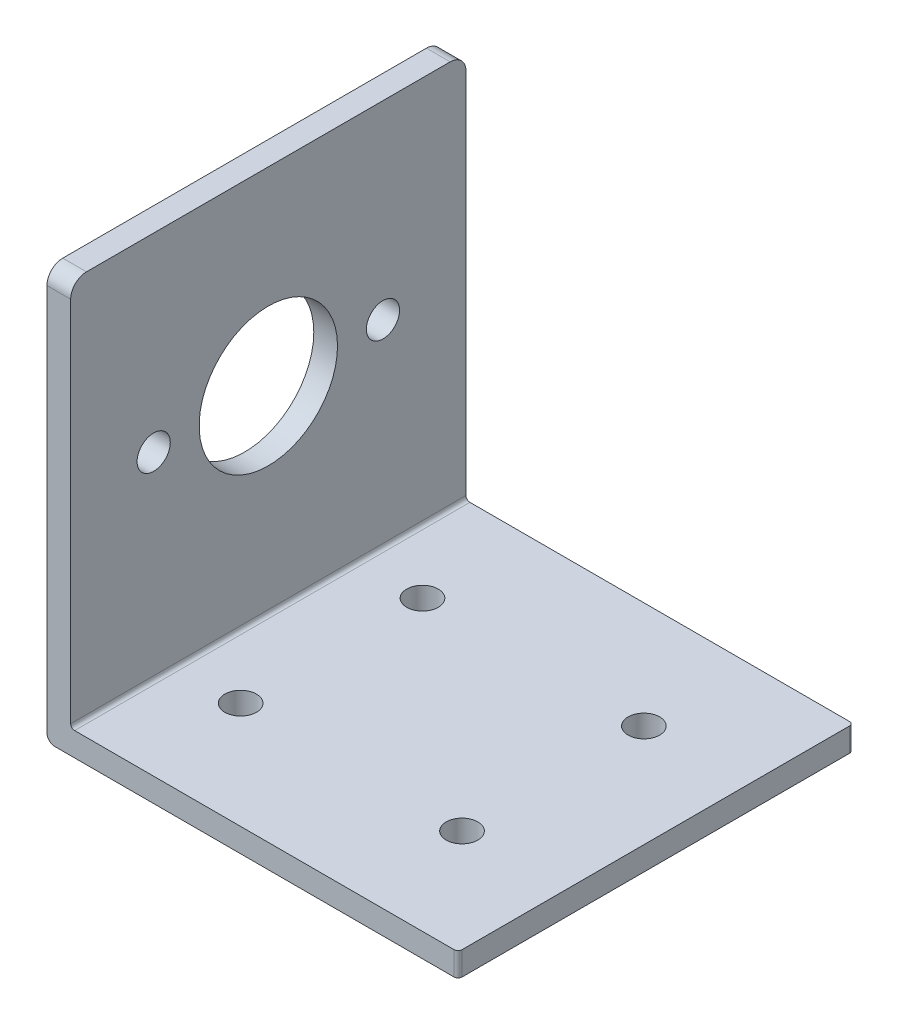
ISO-10303-21;
HEADER;
FILE_DESCRIPTION(('STEP AP214'),'2;1');
FILE_NAME('part.step','',(''),(''),'','','');
FILE_SCHEMA(('AUTOMOTIVE_DESIGN { 1 0 10303 214 1 1 1 1 }'));
ENDSEC;
DATA;
#1=APPLICATION_CONTEXT('core data for automotive mechanical design processes');
#2=APPLICATION_PROTOCOL_DEFINITION('international standard','automotive_design',2000,#1);
#3=PRODUCT_CONTEXT('',#1,'mechanical');
#4=PRODUCT('Part','Part','',(#3));
#5=PRODUCT_RELATED_PRODUCT_CATEGORY('part','',(#4));
#6=PRODUCT_DEFINITION_FORMATION('','',#4);
#7=PRODUCT_DEFINITION_CONTEXT('part definition',#1,'design');
#8=PRODUCT_DEFINITION('design','',#6,#7);
#9=PRODUCT_DEFINITION_SHAPE('','',#8);
#10=(LENGTH_UNIT() NAMED_UNIT(*) SI_UNIT(.MILLI.,.METRE.));
#11=(NAMED_UNIT(*) PLANE_ANGLE_UNIT() SI_UNIT($,.RADIAN.));
#12=(NAMED_UNIT(*) SI_UNIT($,.STERADIAN.) SOLID_ANGLE_UNIT());
#13=UNCERTAINTY_MEASURE_WITH_UNIT(LENGTH_MEASURE(1.E-05),#10,'distance_accuracy_value','');
#14=(GEOMETRIC_REPRESENTATION_CONTEXT(3) GLOBAL_UNCERTAINTY_ASSIGNED_CONTEXT((#13)) GLOBAL_UNIT_ASSIGNED_CONTEXT((#10,
#11,#12)) REPRESENTATION_CONTEXT('',''));
#15=CARTESIAN_POINT('',(0.,0.,0.));
#16=DIRECTION('',(0.,0.,1.));
#17=DIRECTION('',(1.,0.,0.));
#18=AXIS2_PLACEMENT_3D('',#15,#16,#17);
#19=CARTESIAN_POINT('',(49.,0.,50.));
#20=DIRECTION('',(0.,-1.,0.));
#21=DIRECTION('',(1.,0.,0.));
#22=AXIS2_PLACEMENT_3D('',#19,#20,#21);
#23=PLANE('',#22);
#24=CARTESIAN_POINT('',(36.,0.,13.5));
#25=DIRECTION('',(0.,1.,0.));
#26=DIRECTION('',(0.,0.,1.));
#27=AXIS2_PLACEMENT_3D('',#24,#25,#26);
#28=CIRCLE('',#27,2.);
#29=CARTESIAN_POINT('',(36.,0.,15.5));
#30=VERTEX_POINT('',#29);
#31=EDGE_CURVE('E274',#30,#30,#28,.T.);
#32=ORIENTED_EDGE('',*,*,#31,.F.);
#33=EDGE_LOOP('',(#32));
#34=FACE_BOUND('',#33,.T.);
#35=CARTESIAN_POINT('',(8.,0.,13.5));
#36=DIRECTION('',(0.,1.,0.));
#37=DIRECTION('',(0.,0.,1.));
#38=AXIS2_PLACEMENT_3D('',#35,#36,#37);
#39=CIRCLE('',#38,2.);
#40=CARTESIAN_POINT('',(8.,0.,15.5));
#41=VERTEX_POINT('',#40);
#42=EDGE_CURVE('E268',#41,#41,#39,.T.);
#43=ORIENTED_EDGE('',*,*,#42,.F.);
#44=EDGE_LOOP('',(#43));
#45=FACE_BOUND('',#44,.T.);
#46=CARTESIAN_POINT('',(36.,0.,36.5));
#47=DIRECTION('',(0.,1.,0.));
#48=DIRECTION('',(0.,0.,1.));
#49=AXIS2_PLACEMENT_3D('',#46,#47,#48);
#50=CIRCLE('',#49,2.);
#51=CARTESIAN_POINT('',(36.,0.,38.5));
#52=VERTEX_POINT('',#51);
#53=EDGE_CURVE('E262',#52,#52,#50,.T.);
#54=ORIENTED_EDGE('',*,*,#53,.F.);
#55=EDGE_LOOP('',(#54));
#56=FACE_BOUND('',#55,.T.);
#57=CARTESIAN_POINT('',(8.,0.,36.5));
#58=DIRECTION('',(0.,1.,0.));
#59=DIRECTION('',(0.,0.,1.));
#60=AXIS2_PLACEMENT_3D('',#57,#58,#59);
#61=CIRCLE('',#60,2.);
#62=CARTESIAN_POINT('',(8.,0.,38.5));
#63=VERTEX_POINT('',#62);
#64=EDGE_CURVE('E256',#63,#63,#61,.T.);
#65=ORIENTED_EDGE('',*,*,#64,.F.);
#66=EDGE_LOOP('',(#65));
#67=FACE_BOUND('',#66,.T.);
#68=DIRECTION('',(0.,0.,-1.));
#69=VECTOR('',#68,1.);
#70=CARTESIAN_POINT('',(49.,0.,50.));
#71=LINE('',#70,#69);
#72=CARTESIAN_POINT('',(49.,0.,49.5));
#73=VERTEX_POINT('',#72);
#74=CARTESIAN_POINT('',(49.,0.,0.5));
#75=VERTEX_POINT('',#74);
#76=EDGE_CURVE('E152',#73,#75,#71,.T.);
#77=ORIENTED_EDGE('',*,*,#76,.T.);
#78=CARTESIAN_POINT('',(48.5,0.,0.5));
#79=DIRECTION('',(0.,-1.,0.));
#80=DIRECTION('',(1.,0.,0.));
#81=AXIS2_PLACEMENT_3D('',#78,#79,#80);
#82=CIRCLE('',#81,0.5);
#83=CARTESIAN_POINT('',(48.5,0.,0.));
#84=VERTEX_POINT('',#83);
#85=EDGE_CURVE('E224',#75,#84,#82,.F.);
#86=ORIENTED_EDGE('',*,*,#85,.T.);
#87=DIRECTION('',(-1.,0.,0.));
#88=VECTOR('',#87,1.);
#89=CARTESIAN_POINT('',(49.,0.,0.));
#90=LINE('',#89,#88);
#91=CARTESIAN_POINT('',(0.5,0.,0.));
#92=VERTEX_POINT('',#91);
#93=EDGE_CURVE('E156',#84,#92,#90,.T.);
#94=ORIENTED_EDGE('',*,*,#93,.T.);
#95=DIRECTION('',(0.,0.,-1.));
#96=VECTOR('',#95,1.);
#97=CARTESIAN_POINT('',(0.5,0.,50.));
#98=LINE('',#97,#96);
#99=CARTESIAN_POINT('',(0.5,0.,50.));
#100=VERTEX_POINT('',#99);
#101=EDGE_CURVE('E209',#92,#100,#98,.F.);
#102=ORIENTED_EDGE('',*,*,#101,.T.);
#103=DIRECTION('',(-1.,0.,0.));
#104=VECTOR('',#103,1.);
#105=CARTESIAN_POINT('',(49.,0.,50.));
#106=LINE('',#105,#104);
#107=CARTESIAN_POINT('',(48.5,0.,50.));
#108=VERTEX_POINT('',#107);
#109=EDGE_CURVE('E166',#108,#100,#106,.T.);
#110=ORIENTED_EDGE('',*,*,#109,.F.);
#111=CARTESIAN_POINT('',(48.5,0.,49.5));
#112=DIRECTION('',(0.,-1.,0.));
#113=DIRECTION('',(1.,0.,0.));
#114=AXIS2_PLACEMENT_3D('',#111,#112,#113);
#115=CIRCLE('',#114,0.5);
#116=EDGE_CURVE('E222',#108,#73,#115,.F.);
#117=ORIENTED_EDGE('',*,*,#116,.T.);
#118=EDGE_LOOP('',(#77,#86,#94,#102,#110,#117));
#119=FACE_BOUND('',#118,.T.);
#120=ADVANCED_FACE('F33',(#34,#45,#56,#67,#119),#23,.F.);
#121=CARTESIAN_POINT('',(0.,0.,50.));
#122=DIRECTION('',(-1.,0.,0.));
#123=DIRECTION('',(0.,0.,1.));
#124=AXIS2_PLACEMENT_3D('',#121,#122,#123);
#125=PLANE('',#124);
#126=CARTESIAN_POINT('',(0.,25.,39.5));
#127=DIRECTION('',(1.,0.,0.));
#128=DIRECTION('',(0.,0.,-1.));
#129=AXIS2_PLACEMENT_3D('',#126,#127,#128);
#130=CIRCLE('',#129,2.1);
#131=CARTESIAN_POINT('',(0.,25.,37.4));
#132=VERTEX_POINT('',#131);
#133=EDGE_CURVE('E188',#132,#132,#130,.T.);
#134=ORIENTED_EDGE('',*,*,#133,.F.);
#135=EDGE_LOOP('',(#134));
#136=FACE_BOUND('',#135,.T.);
#137=CARTESIAN_POINT('',(0.,25.,10.5));
#138=DIRECTION('',(1.,0.,0.));
#139=DIRECTION('',(0.,0.,-1.));
#140=AXIS2_PLACEMENT_3D('',#137,#138,#139);
#141=CIRCLE('',#140,2.1);
#142=CARTESIAN_POINT('',(0.,25.,8.4));
#143=VERTEX_POINT('',#142);
#144=EDGE_CURVE('E184',#143,#143,#141,.T.);
#145=ORIENTED_EDGE('',*,*,#144,.F.);
#146=EDGE_LOOP('',(#145));
#147=FACE_BOUND('',#146,.T.);
#148=CARTESIAN_POINT('',(0.,25.,25.));
#149=DIRECTION('',(1.,0.,0.));
#150=DIRECTION('',(0.,0.,-1.));
#151=AXIS2_PLACEMENT_3D('',#148,#149,#150);
#152=CIRCLE('',#151,8.75);
#153=CARTESIAN_POINT('',(0.,25.,16.25));
#154=VERTEX_POINT('',#153);
#155=EDGE_CURVE('E180',#154,#154,#152,.T.);
#156=ORIENTED_EDGE('',*,*,#155,.F.);
#157=EDGE_LOOP('',(#156));
#158=FACE_BOUND('',#157,.T.);
#159=DIRECTION('',(0.,1.,0.));
#160=VECTOR('',#159,1.);
#161=CARTESIAN_POINT('',(0.,0.,50.));
#162=LINE('',#161,#160);
#163=CARTESIAN_POINT('',(0.,0.5,50.));
#164=VERTEX_POINT('',#163);
#165=CARTESIAN_POINT('',(0.,47.,50.));
#166=VERTEX_POINT('',#165);
#167=EDGE_CURVE('E135',#164,#166,#162,.T.);
#168=ORIENTED_EDGE('',*,*,#167,.F.);
#169=DIRECTION('',(0.,0.,-1.));
#170=VECTOR('',#169,1.);
#171=CARTESIAN_POINT('',(0.,0.5,0.));
#172=LINE('',#171,#170);
#173=CARTESIAN_POINT('',(0.,0.5,0.));
#174=VERTEX_POINT('',#173);
#175=EDGE_CURVE('E206',#164,#174,#172,.T.);
#176=ORIENTED_EDGE('',*,*,#175,.T.);
#177=DIRECTION('',(0.,1.,0.));
#178=VECTOR('',#177,1.);
#179=CARTESIAN_POINT('',(0.,0.,0.));
#180=LINE('',#179,#178);
#181=CARTESIAN_POINT('',(0.,47.,0.));
#182=VERTEX_POINT('',#181);
#183=EDGE_CURVE('E158',#174,#182,#180,.T.);
#184=ORIENTED_EDGE('',*,*,#183,.T.);
#185=CARTESIAN_POINT('',(0.,47.,2.));
#186=DIRECTION('',(-1.,0.,0.));
#187=DIRECTION('',(0.,0.,1.));
#188=AXIS2_PLACEMENT_3D('',#185,#186,#187);
#189=CIRCLE('',#188,2.);
#190=CARTESIAN_POINT('',(0.,49.,2.));
#191=VERTEX_POINT('',#190);
#192=EDGE_CURVE('E194',#182,#191,#189,.F.);
#193=ORIENTED_EDGE('',*,*,#192,.T.);
#194=DIRECTION('',(0.,0.,-1.));
#195=VECTOR('',#194,1.);
#196=CARTESIAN_POINT('',(0.,49.,50.));
#197=LINE('',#196,#195);
#198=CARTESIAN_POINT('',(0.,49.,48.));
#199=VERTEX_POINT('',#198);
#200=EDGE_CURVE('E174',#199,#191,#197,.T.);
#201=ORIENTED_EDGE('',*,*,#200,.F.);
#202=CARTESIAN_POINT('',(0.,47.,48.));
#203=DIRECTION('',(-1.,0.,0.));
#204=DIRECTION('',(0.,0.,1.));
#205=AXIS2_PLACEMENT_3D('',#202,#203,#204);
#206=CIRCLE('',#205,2.);
#207=EDGE_CURVE('E191',#199,#166,#206,.F.);
#208=ORIENTED_EDGE('',*,*,#207,.T.);
#209=EDGE_LOOP('',(#168,#176,#184,#193,#201,#208));
#210=FACE_BOUND('',#209,.T.);
#211=ADVANCED_FACE('F282',(#136,#147,#158,#210),#125,.F.);
#212=CARTESIAN_POINT('',(-3.,49.,50.));
#213=DIRECTION('',(0.,1.,0.));
#214=DIRECTION('',(0.,0.,1.));
#215=AXIS2_PLACEMENT_3D('',#212,#213,#214);
#216=PLANE('',#215);
#217=ORIENTED_EDGE('',*,*,#200,.T.);
#218=DIRECTION('',(1.,0.,0.));
#219=VECTOR('',#218,1.);
#220=CARTESIAN_POINT('',(-3.,49.,2.));
#221=LINE('',#220,#219);
#222=CARTESIAN_POINT('',(-3.,49.,2.));
#223=VERTEX_POINT('',#222);
#224=EDGE_CURVE('E199',#191,#223,#221,.F.);
#225=ORIENTED_EDGE('',*,*,#224,.T.);
#226=DIRECTION('',(0.,0.,-1.));
#227=VECTOR('',#226,1.);
#228=CARTESIAN_POINT('',(-3.,49.,50.));
#229=LINE('',#228,#227);
#230=CARTESIAN_POINT('',(-3.,49.,48.));
#231=VERTEX_POINT('',#230);
#232=EDGE_CURVE('E145',#231,#223,#229,.T.);
#233=ORIENTED_EDGE('',*,*,#232,.F.);
#234=DIRECTION('',(1.,0.,0.));
#235=VECTOR('',#234,1.);
#236=CARTESIAN_POINT('',(-3.,49.,48.));
#237=LINE('',#236,#235);
#238=EDGE_CURVE('E196',#231,#199,#237,.T.);
#239=ORIENTED_EDGE('',*,*,#238,.T.);
#240=EDGE_LOOP('',(#217,#225,#233,#239));
#241=FACE_BOUND('',#240,.T.);
#242=ADVANCED_FACE('F332',(#241),#216,.T.);
#243=CARTESIAN_POINT('',(-3.,49.,50.));
#244=DIRECTION('',(1.,0.,0.));
#245=DIRECTION('',(0.,1.,0.));
#246=AXIS2_PLACEMENT_3D('',#243,#244,#245);
#247=PLANE('',#246);
#248=CARTESIAN_POINT('',(-3.,25.,39.5));
#249=DIRECTION('',(1.,0.,0.));
#250=DIRECTION('',(0.,1.,0.));
#251=AXIS2_PLACEMENT_3D('',#248,#249,#250);
#252=CIRCLE('',#251,2.1);
#253=CARTESIAN_POINT('',(-3.,27.1,39.5));
#254=VERTEX_POINT('',#253);
#255=EDGE_CURVE('E185',#254,#254,#252,.T.);
#256=ORIENTED_EDGE('',*,*,#255,.T.);
#257=EDGE_LOOP('',(#256));
#258=FACE_BOUND('',#257,.T.);
#259=CARTESIAN_POINT('',(-3.,25.,10.5));
#260=DIRECTION('',(1.,0.,0.));
#261=DIRECTION('',(0.,1.,0.));
#262=AXIS2_PLACEMENT_3D('',#259,#260,#261);
#263=CIRCLE('',#262,2.1);
#264=CARTESIAN_POINT('',(-3.,27.1,10.5));
#265=VERTEX_POINT('',#264);
#266=EDGE_CURVE('E181',#265,#265,#263,.T.);
#267=ORIENTED_EDGE('',*,*,#266,.T.);
#268=EDGE_LOOP('',(#267));
#269=FACE_BOUND('',#268,.T.);
#270=CARTESIAN_POINT('',(-3.,25.,25.));
#271=DIRECTION('',(1.,0.,0.));
#272=DIRECTION('',(0.,1.,0.));
#273=AXIS2_PLACEMENT_3D('',#270,#271,#272);
#274=CIRCLE('',#273,8.75);
#275=CARTESIAN_POINT('',(-3.,33.75,25.));
#276=VERTEX_POINT('',#275);
#277=EDGE_CURVE('E159',#276,#276,#274,.T.);
#278=ORIENTED_EDGE('',*,*,#277,.T.);
#279=EDGE_LOOP('',(#278));
#280=FACE_BOUND('',#279,.T.);
#281=ORIENTED_EDGE('',*,*,#232,.T.);
#282=CARTESIAN_POINT('',(-3.,47.,2.));
#283=DIRECTION('',(1.,0.,0.));
#284=DIRECTION('',(0.,1.,0.));
#285=AXIS2_PLACEMENT_3D('',#282,#283,#284);
#286=CIRCLE('',#285,2.);
#287=CARTESIAN_POINT('',(-3.,47.,0.));
#288=VERTEX_POINT('',#287);
#289=EDGE_CURVE('E203',#223,#288,#286,.F.);
#290=ORIENTED_EDGE('',*,*,#289,.T.);
#291=DIRECTION('',(0.,-1.,0.));
#292=VECTOR('',#291,1.);
#293=CARTESIAN_POINT('',(-3.,49.,0.));
#294=LINE('',#293,#292);
#295=CARTESIAN_POINT('',(-3.,-2.,0.));
#296=VERTEX_POINT('',#295);
#297=EDGE_CURVE('E142',#288,#296,#294,.T.);
#298=ORIENTED_EDGE('',*,*,#297,.T.);
#299=DIRECTION('',(0.,0.,-1.));
#300=VECTOR('',#299,1.);
#301=CARTESIAN_POINT('',(-3.,-2.,50.));
#302=LINE('',#301,#300);
#303=CARTESIAN_POINT('',(-3.,-2.,50.));
#304=VERTEX_POINT('',#303);
#305=EDGE_CURVE('E138',#304,#296,#302,.T.);
#306=ORIENTED_EDGE('',*,*,#305,.F.);
#307=DIRECTION('',(0.,-1.,0.));
#308=VECTOR('',#307,1.);
#309=CARTESIAN_POINT('',(-3.,49.,50.));
#310=LINE('',#309,#308);
#311=CARTESIAN_POINT('',(-3.,47.,50.));
#312=VERTEX_POINT('',#311);
#313=EDGE_CURVE('E125',#312,#304,#310,.T.);
#314=ORIENTED_EDGE('',*,*,#313,.F.);
#315=CARTESIAN_POINT('',(-3.,47.,48.));
#316=DIRECTION('',(1.,0.,0.));
#317=DIRECTION('',(0.,1.,0.));
#318=AXIS2_PLACEMENT_3D('',#315,#316,#317);
#319=CIRCLE('',#318,2.);
#320=EDGE_CURVE('E201',#312,#231,#319,.F.);
#321=ORIENTED_EDGE('',*,*,#320,.T.);
#322=EDGE_LOOP('',(#281,#290,#298,#306,#314,#321));
#323=FACE_BOUND('',#322,.T.);
#324=ADVANCED_FACE('F140',(#258,#269,#280,#323),#247,.F.);
#325=CARTESIAN_POINT('',(-2.,-2.,50.));
#326=DIRECTION('',(0.,0.,-1.));
#327=DIRECTION('',(-1.,0.,0.));
#328=AXIS2_PLACEMENT_3D('',#325,#326,#327);
#329=CYLINDRICAL_SURFACE('',#328,1.);
#330=CARTESIAN_POINT('',(-2.,-2.,0.));
#331=DIRECTION('',(0.,0.,1.));
#332=DIRECTION('',(1.,0.,0.));
#333=AXIS2_PLACEMENT_3D('',#330,#331,#332);
#334=CIRCLE('',#333,1.);
#335=CARTESIAN_POINT('',(-2.,-3.,0.));
#336=VERTEX_POINT('',#335);
#337=EDGE_CURVE('E162',#296,#336,#334,.T.);
#338=ORIENTED_EDGE('',*,*,#337,.T.);
#339=DIRECTION('',(0.,0.,-1.));
#340=VECTOR('',#339,1.);
#341=CARTESIAN_POINT('',(-2.,-3.,50.));
#342=LINE('',#341,#340);
#343=CARTESIAN_POINT('',(-2.,-3.,50.));
#344=VERTEX_POINT('',#343);
#345=EDGE_CURVE('E146',#344,#336,#342,.T.);
#346=ORIENTED_EDGE('',*,*,#345,.F.);
#347=CARTESIAN_POINT('',(-2.,-2.,50.));
#348=DIRECTION('',(0.,0.,1.));
#349=DIRECTION('',(1.,0.,0.));
#350=AXIS2_PLACEMENT_3D('',#347,#348,#349);
#351=CIRCLE('',#350,1.);
#352=EDGE_CURVE('E129',#304,#344,#351,.T.);
#353=ORIENTED_EDGE('',*,*,#352,.F.);
#354=ORIENTED_EDGE('',*,*,#305,.T.);
#355=EDGE_LOOP('',(#338,#346,#353,#354));
#356=FACE_BOUND('',#355,.T.);
#357=ADVANCED_FACE('F148',(#356),#329,.T.);
#358=CARTESIAN_POINT('',(-2.,-3.,50.));
#359=DIRECTION('',(0.,1.,0.));
#360=DIRECTION('',(0.,0.,1.));
#361=AXIS2_PLACEMENT_3D('',#358,#359,#360);
#362=PLANE('',#361);
#363=CARTESIAN_POINT('',(36.,-3.,13.5));
#364=DIRECTION('',(0.,1.,0.));
#365=DIRECTION('',(0.,0.,1.));
#366=AXIS2_PLACEMENT_3D('',#363,#364,#365);
#367=CIRCLE('',#366,2.);
#368=CARTESIAN_POINT('',(36.,-3.,15.5));
#369=VERTEX_POINT('',#368);
#370=EDGE_CURVE('E271',#369,#369,#367,.T.);
#371=ORIENTED_EDGE('',*,*,#370,.T.);
#372=EDGE_LOOP('',(#371));
#373=FACE_BOUND('',#372,.T.);
#374=CARTESIAN_POINT('',(8.,-3.00000000000001,13.5));
#375=DIRECTION('',(0.,1.,0.));
#376=DIRECTION('',(0.,0.,1.));
#377=AXIS2_PLACEMENT_3D('',#374,#375,#376);
#378=CIRCLE('',#377,2.);
#379=CARTESIAN_POINT('',(8.,-3.00000000000001,15.5));
#380=VERTEX_POINT('',#379);
#381=EDGE_CURVE('E265',#380,#380,#378,.T.);
#382=ORIENTED_EDGE('',*,*,#381,.T.);
#383=EDGE_LOOP('',(#382));
#384=FACE_BOUND('',#383,.T.);
#385=CARTESIAN_POINT('',(36.,-3.,36.5));
#386=DIRECTION('',(0.,1.,0.));
#387=DIRECTION('',(0.,0.,1.));
#388=AXIS2_PLACEMENT_3D('',#385,#386,#387);
#389=CIRCLE('',#388,2.);
#390=CARTESIAN_POINT('',(36.,-3.,38.5));
#391=VERTEX_POINT('',#390);
#392=EDGE_CURVE('E259',#391,#391,#389,.T.);
#393=ORIENTED_EDGE('',*,*,#392,.T.);
#394=EDGE_LOOP('',(#393));
#395=FACE_BOUND('',#394,.T.);
#396=CARTESIAN_POINT('',(8.,-3.00000000000001,36.5));
#397=DIRECTION('',(0.,1.,0.));
#398=DIRECTION('',(0.,0.,1.));
#399=AXIS2_PLACEMENT_3D('',#396,#397,#398);
#400=CIRCLE('',#399,2.);
#401=CARTESIAN_POINT('',(8.,-3.00000000000001,38.5));
#402=VERTEX_POINT('',#401);
#403=EDGE_CURVE('E253',#402,#402,#400,.T.);
#404=ORIENTED_EDGE('',*,*,#403,.T.);
#405=EDGE_LOOP('',(#404));
#406=FACE_BOUND('',#405,.T.);
#407=DIRECTION('',(1.,0.,0.));
#408=VECTOR('',#407,1.);
#409=CARTESIAN_POINT('',(-2.,-3.,0.));
#410=LINE('',#409,#408);
#411=CARTESIAN_POINT('',(48.5,-3.,0.));
#412=VERTEX_POINT('',#411);
#413=EDGE_CURVE('E164',#336,#412,#410,.T.);
#414=ORIENTED_EDGE('',*,*,#413,.T.);
#415=CARTESIAN_POINT('',(48.5,-3.,0.5));
#416=DIRECTION('',(0.,1.,0.));
#417=DIRECTION('',(0.,0.,1.));
#418=AXIS2_PLACEMENT_3D('',#415,#416,#417);
#419=CIRCLE('',#418,0.5);
#420=CARTESIAN_POINT('',(49.,-3.,0.5));
#421=VERTEX_POINT('',#420);
#422=EDGE_CURVE('E41',#412,#421,#419,.F.);
#423=ORIENTED_EDGE('',*,*,#422,.T.);
#424=DIRECTION('',(0.,0.,-1.));
#425=VECTOR('',#424,1.);
#426=CARTESIAN_POINT('',(49.,-3.,50.));
#427=LINE('',#426,#425);
#428=CARTESIAN_POINT('',(49.,-3.,49.5));
#429=VERTEX_POINT('',#428);
#430=EDGE_CURVE('E169',#429,#421,#427,.T.);
#431=ORIENTED_EDGE('',*,*,#430,.F.);
#432=CARTESIAN_POINT('',(48.5,-3.,49.5));
#433=DIRECTION('',(0.,1.,0.));
#434=DIRECTION('',(0.,0.,1.));
#435=AXIS2_PLACEMENT_3D('',#432,#433,#434);
#436=CIRCLE('',#435,0.5);
#437=CARTESIAN_POINT('',(48.5,-3.,50.));
#438=VERTEX_POINT('',#437);
#439=EDGE_CURVE('E48',#429,#438,#436,.F.);
#440=ORIENTED_EDGE('',*,*,#439,.T.);
#441=DIRECTION('',(1.,0.,0.));
#442=VECTOR('',#441,1.);
#443=CARTESIAN_POINT('',(-2.,-3.,50.));
#444=LINE('',#443,#442);
#445=EDGE_CURVE('E150',#344,#438,#444,.T.);
#446=ORIENTED_EDGE('',*,*,#445,.F.);
#447=ORIENTED_EDGE('',*,*,#345,.T.);
#448=EDGE_LOOP('',(#414,#423,#431,#440,#446,#447));
#449=FACE_BOUND('',#448,.T.);
#450=ADVANCED_FACE('F228',(#373,#384,#395,#406,#449),#362,.F.);
#451=CARTESIAN_POINT('',(49.,-3.,50.));
#452=DIRECTION('',(-1.,0.,0.));
#453=DIRECTION('',(0.,0.,1.));
#454=AXIS2_PLACEMENT_3D('',#451,#452,#453);
#455=PLANE('',#454);
#456=ORIENTED_EDGE('',*,*,#430,.T.);
#457=DIRECTION('',(0.,1.,0.));
#458=VECTOR('',#457,1.);
#459=CARTESIAN_POINT('',(49.,-3.,0.5));
#460=LINE('',#459,#458);
#461=EDGE_CURVE('E219',#421,#75,#460,.T.);
#462=ORIENTED_EDGE('',*,*,#461,.T.);
#463=ORIENTED_EDGE('',*,*,#76,.F.);
#464=DIRECTION('',(0.,1.,0.));
#465=VECTOR('',#464,1.);
#466=CARTESIAN_POINT('',(49.,-3.,49.5));
#467=LINE('',#466,#465);
#468=EDGE_CURVE('E217',#73,#429,#467,.F.);
#469=ORIENTED_EDGE('',*,*,#468,.T.);
#470=EDGE_LOOP('',(#456,#462,#463,#469));
#471=FACE_BOUND('',#470,.T.);
#472=ADVANCED_FACE('F232',(#471),#455,.F.);
#473=CARTESIAN_POINT('',(-2.,-2.,50.));
#474=DIRECTION('',(0.,0.,1.));
#475=DIRECTION('',(1.,0.,0.));
#476=AXIS2_PLACEMENT_3D('',#473,#474,#475);
#477=PLANE('',#476);
#478=ORIENTED_EDGE('',*,*,#445,.T.);
#479=DIRECTION('',(0.,1.,0.));
#480=VECTOR('',#479,1.);
#481=CARTESIAN_POINT('',(48.5,0.,50.));
#482=LINE('',#481,#480);
#483=EDGE_CURVE('E11',#438,#108,#482,.T.);
#484=ORIENTED_EDGE('',*,*,#483,.T.);
#485=ORIENTED_EDGE('',*,*,#109,.T.);
#486=CARTESIAN_POINT('',(0.5,0.5,50.));
#487=DIRECTION('',(0.,0.,1.));
#488=DIRECTION('',(1.,0.,0.));
#489=AXIS2_PLACEMENT_3D('',#486,#487,#488);
#490=CIRCLE('',#489,0.5);
#491=EDGE_CURVE('E215',#100,#164,#490,.F.);
#492=ORIENTED_EDGE('',*,*,#491,.T.);
#493=ORIENTED_EDGE('',*,*,#167,.T.);
#494=DIRECTION('',(1.,0.,0.));
#495=VECTOR('',#494,1.);
#496=CARTESIAN_POINT('',(-2.,47.,50.));
#497=LINE('',#496,#495);
#498=EDGE_CURVE('E132',#166,#312,#497,.F.);
#499=ORIENTED_EDGE('',*,*,#498,.T.);
#500=ORIENTED_EDGE('',*,*,#313,.T.);
#501=ORIENTED_EDGE('',*,*,#352,.T.);
#502=EDGE_LOOP('',(#478,#484,#485,#492,#493,#499,#500,#501));
#503=FACE_BOUND('',#502,.T.);
#504=ADVANCED_FACE('F127',(#503),#477,.T.);
#505=CARTESIAN_POINT('',(-2.,-2.,0.));
#506=DIRECTION('',(0.,0.,1.));
#507=DIRECTION('',(1.,0.,0.));
#508=AXIS2_PLACEMENT_3D('',#505,#506,#507);
#509=PLANE('',#508);
#510=ORIENTED_EDGE('',*,*,#93,.F.);
#511=DIRECTION('',(0.,1.,0.));
#512=VECTOR('',#511,1.);
#513=CARTESIAN_POINT('',(48.5,-2.,0.));
#514=LINE('',#513,#512);
#515=EDGE_CURVE('E56',#84,#412,#514,.F.);
#516=ORIENTED_EDGE('',*,*,#515,.T.);
#517=ORIENTED_EDGE('',*,*,#413,.F.);
#518=ORIENTED_EDGE('',*,*,#337,.F.);
#519=ORIENTED_EDGE('',*,*,#297,.F.);
#520=DIRECTION('',(1.,0.,0.));
#521=VECTOR('',#520,1.);
#522=CARTESIAN_POINT('',(0.,47.,0.));
#523=LINE('',#522,#521);
#524=EDGE_CURVE('E177',#288,#182,#523,.T.);
#525=ORIENTED_EDGE('',*,*,#524,.T.);
#526=ORIENTED_EDGE('',*,*,#183,.F.);
#527=CARTESIAN_POINT('',(0.5,0.5,0.));
#528=DIRECTION('',(0.,0.,1.));
#529=DIRECTION('',(1.,0.,0.));
#530=AXIS2_PLACEMENT_3D('',#527,#528,#529);
#531=CIRCLE('',#530,0.5);
#532=EDGE_CURVE('E212',#174,#92,#531,.T.);
#533=ORIENTED_EDGE('',*,*,#532,.T.);
#534=EDGE_LOOP('',(#510,#516,#517,#518,#519,#525,#526,#533));
#535=FACE_BOUND('',#534,.T.);
#536=ADVANCED_FACE('F237',(#535),#509,.F.);
#537=CARTESIAN_POINT('',(-10.,25.,25.));
#538=DIRECTION('',(1.,0.,0.));
#539=DIRECTION('',(0.,0.,-1.));
#540=AXIS2_PLACEMENT_3D('',#537,#538,#539);
#541=CYLINDRICAL_SURFACE('',#540,8.75);
#542=ORIENTED_EDGE('',*,*,#155,.T.);
#543=EDGE_LOOP('',(#542));
#544=FACE_BOUND('',#543,.T.);
#545=ORIENTED_EDGE('',*,*,#277,.F.);
#546=EDGE_LOOP('',(#545));
#547=FACE_BOUND('',#546,.T.);
#548=ADVANCED_FACE('F314',(#544,#547),#541,.F.);
#549=CARTESIAN_POINT('',(-10.,25.,10.5));
#550=DIRECTION('',(1.,0.,0.));
#551=DIRECTION('',(0.,0.,-1.));
#552=AXIS2_PLACEMENT_3D('',#549,#550,#551);
#553=CYLINDRICAL_SURFACE('',#552,2.1);
#554=ORIENTED_EDGE('',*,*,#144,.T.);
#555=EDGE_LOOP('',(#554));
#556=FACE_BOUND('',#555,.T.);
#557=ORIENTED_EDGE('',*,*,#266,.F.);
#558=EDGE_LOOP('',(#557));
#559=FACE_BOUND('',#558,.T.);
#560=ADVANCED_FACE('F310',(#556,#559),#553,.F.);
#561=CARTESIAN_POINT('',(-10.,25.,39.5));
#562=DIRECTION('',(1.,0.,0.));
#563=DIRECTION('',(0.,0.,-1.));
#564=AXIS2_PLACEMENT_3D('',#561,#562,#563);
#565=CYLINDRICAL_SURFACE('',#564,2.1);
#566=ORIENTED_EDGE('',*,*,#133,.T.);
#567=EDGE_LOOP('',(#566));
#568=FACE_BOUND('',#567,.T.);
#569=ORIENTED_EDGE('',*,*,#255,.F.);
#570=EDGE_LOOP('',(#569));
#571=FACE_BOUND('',#570,.T.);
#572=ADVANCED_FACE('F306',(#568,#571),#565,.F.);
#573=CARTESIAN_POINT('',(-2.,47.,2.));
#574=DIRECTION('',(-1.,0.,0.));
#575=DIRECTION('',(0.,0.,1.));
#576=AXIS2_PLACEMENT_3D('',#573,#574,#575);
#577=CYLINDRICAL_SURFACE('',#576,2.);
#578=ORIENTED_EDGE('',*,*,#289,.F.);
#579=ORIENTED_EDGE('',*,*,#224,.F.);
#580=ORIENTED_EDGE('',*,*,#192,.F.);
#581=ORIENTED_EDGE('',*,*,#524,.F.);
#582=EDGE_LOOP('',(#578,#579,#580,#581));
#583=FACE_BOUND('',#582,.T.);
#584=ADVANCED_FACE('F309',(#583),#577,.T.);
#585=CARTESIAN_POINT('',(-3.,47.,48.));
#586=DIRECTION('',(1.,0.,0.));
#587=DIRECTION('',(0.,0.,-1.));
#588=AXIS2_PLACEMENT_3D('',#585,#586,#587);
#589=CYLINDRICAL_SURFACE('',#588,2.);
#590=ORIENTED_EDGE('',*,*,#320,.F.);
#591=ORIENTED_EDGE('',*,*,#498,.F.);
#592=ORIENTED_EDGE('',*,*,#207,.F.);
#593=ORIENTED_EDGE('',*,*,#238,.F.);
#594=EDGE_LOOP('',(#590,#591,#592,#593));
#595=FACE_BOUND('',#594,.T.);
#596=ADVANCED_FACE('F342',(#595),#589,.T.);
#597=CARTESIAN_POINT('',(0.5,0.5,50.));
#598=DIRECTION('',(0.,0.,1.));
#599=DIRECTION('',(1.,0.,0.));
#600=AXIS2_PLACEMENT_3D('',#597,#598,#599);
#601=CYLINDRICAL_SURFACE('',#600,0.5);
#602=ORIENTED_EDGE('',*,*,#491,.F.);
#603=ORIENTED_EDGE('',*,*,#101,.F.);
#604=ORIENTED_EDGE('',*,*,#532,.F.);
#605=ORIENTED_EDGE('',*,*,#175,.F.);
#606=EDGE_LOOP('',(#602,#603,#604,#605));
#607=FACE_BOUND('',#606,.T.);
#608=ADVANCED_FACE('F243',(#607),#601,.F.);
#609=CARTESIAN_POINT('',(48.5,-3.,0.5));
#610=DIRECTION('',(0.,1.,0.));
#611=DIRECTION('',(0.,0.,1.));
#612=AXIS2_PLACEMENT_3D('',#609,#610,#611);
#613=CYLINDRICAL_SURFACE('',#612,0.5);
#614=ORIENTED_EDGE('',*,*,#422,.F.);
#615=ORIENTED_EDGE('',*,*,#515,.F.);
#616=ORIENTED_EDGE('',*,*,#85,.F.);
#617=ORIENTED_EDGE('',*,*,#461,.F.);
#618=EDGE_LOOP('',(#614,#615,#616,#617));
#619=FACE_BOUND('',#618,.T.);
#620=ADVANCED_FACE('F235',(#619),#613,.T.);
#621=CARTESIAN_POINT('',(48.5,-2.,49.5));
#622=DIRECTION('',(0.,-1.,0.));
#623=DIRECTION('',(0.,0.,-1.));
#624=AXIS2_PLACEMENT_3D('',#621,#622,#623);
#625=CYLINDRICAL_SURFACE('',#624,0.5);
#626=ORIENTED_EDGE('',*,*,#439,.F.);
#627=ORIENTED_EDGE('',*,*,#468,.F.);
#628=ORIENTED_EDGE('',*,*,#116,.F.);
#629=ORIENTED_EDGE('',*,*,#483,.F.);
#630=EDGE_LOOP('',(#626,#627,#628,#629));
#631=FACE_BOUND('',#630,.T.);
#632=ADVANCED_FACE('F35',(#631),#625,.T.);
#633=CARTESIAN_POINT('',(8.,0.,36.5));
#634=DIRECTION('',(0.,1.,0.));
#635=DIRECTION('',(0.,0.,1.));
#636=AXIS2_PLACEMENT_3D('',#633,#634,#635);
#637=CYLINDRICAL_SURFACE('',#636,2.);
#638=ORIENTED_EDGE('',*,*,#403,.F.);
#639=EDGE_LOOP('',(#638));
#640=FACE_BOUND('',#639,.T.);
#641=ORIENTED_EDGE('',*,*,#64,.T.);
#642=EDGE_LOOP('',(#641));
#643=FACE_BOUND('',#642,.T.);
#644=ADVANCED_FACE('F290',(#640,#643),#637,.F.);
#645=CARTESIAN_POINT('',(36.,0.,36.5));
#646=DIRECTION('',(0.,1.,0.));
#647=DIRECTION('',(0.,0.,1.));
#648=AXIS2_PLACEMENT_3D('',#645,#646,#647);
#649=CYLINDRICAL_SURFACE('',#648,2.);
#650=ORIENTED_EDGE('',*,*,#392,.F.);
#651=EDGE_LOOP('',(#650));
#652=FACE_BOUND('',#651,.T.);
#653=ORIENTED_EDGE('',*,*,#53,.T.);
#654=EDGE_LOOP('',(#653));
#655=FACE_BOUND('',#654,.T.);
#656=ADVANCED_FACE('F292',(#652,#655),#649,.F.);
#657=CARTESIAN_POINT('',(8.,0.,13.5));
#658=DIRECTION('',(0.,1.,0.));
#659=DIRECTION('',(0.,0.,1.));
#660=AXIS2_PLACEMENT_3D('',#657,#658,#659);
#661=CYLINDRICAL_SURFACE('',#660,2.);
#662=ORIENTED_EDGE('',*,*,#381,.F.);
#663=EDGE_LOOP('',(#662));
#664=FACE_BOUND('',#663,.T.);
#665=ORIENTED_EDGE('',*,*,#42,.T.);
#666=EDGE_LOOP('',(#665));
#667=FACE_BOUND('',#666,.T.);
#668=ADVANCED_FACE('F299',(#664,#667),#661,.F.);
#669=CARTESIAN_POINT('',(36.,0.,13.5));
#670=DIRECTION('',(0.,1.,0.));
#671=DIRECTION('',(0.,0.,1.));
#672=AXIS2_PLACEMENT_3D('',#669,#670,#671);
#673=CYLINDRICAL_SURFACE('',#672,2.);
#674=ORIENTED_EDGE('',*,*,#370,.F.);
#675=EDGE_LOOP('',(#674));
#676=FACE_BOUND('',#675,.T.);
#677=ORIENTED_EDGE('',*,*,#31,.T.);
#678=EDGE_LOOP('',(#677));
#679=FACE_BOUND('',#678,.T.);
#680=ADVANCED_FACE('F278',(#676,#679),#673,.F.);
#681=CLOSED_SHELL('',(#120,#211,#242,#324,#357,#450,#472,#504,#536,#548,#560,#572,#584,#596,
#608,#620,#632,#644,#656,#668,#680));
#682=MANIFOLD_SOLID_BREP('B2',#681);
#683=ADVANCED_BREP_SHAPE_REPRESENTATION('',(#18,#682),#14);
#684=SHAPE_DEFINITION_REPRESENTATION(#9,#683);
ENDSEC;
END-ISO-10303-21;
